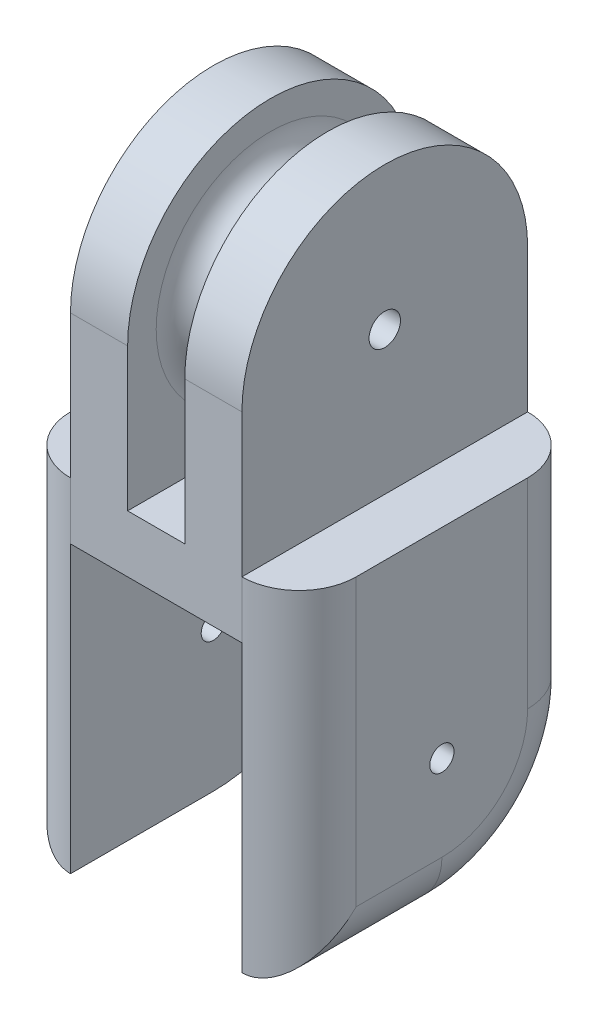
ISO-10303-21;
HEADER;
FILE_DESCRIPTION(('STEP AP214'),'2;1');
FILE_NAME('part.step','',(''),(''),'','','');
FILE_SCHEMA(('AUTOMOTIVE_DESIGN { 1 0 10303 214 1 1 1 1 }'));
ENDSEC;
DATA;
#1=APPLICATION_CONTEXT('core data for automotive mechanical design processes');
#2=APPLICATION_PROTOCOL_DEFINITION('international standard','automotive_design',2000,#1);
#3=PRODUCT_CONTEXT('',#1,'mechanical');
#4=PRODUCT('Part','Part','',(#3));
#5=PRODUCT_RELATED_PRODUCT_CATEGORY('part','',(#4));
#6=PRODUCT_DEFINITION_FORMATION('','',#4);
#7=PRODUCT_DEFINITION_CONTEXT('part definition',#1,'design');
#8=PRODUCT_DEFINITION('design','',#6,#7);
#9=PRODUCT_DEFINITION_SHAPE('','',#8);
#10=(LENGTH_UNIT() NAMED_UNIT(*) SI_UNIT(.MILLI.,.METRE.));
#11=(NAMED_UNIT(*) PLANE_ANGLE_UNIT() SI_UNIT($,.RADIAN.));
#12=(NAMED_UNIT(*) SI_UNIT($,.STERADIAN.) SOLID_ANGLE_UNIT());
#13=UNCERTAINTY_MEASURE_WITH_UNIT(LENGTH_MEASURE(1.E-05),#10,'distance_accuracy_value','');
#14=(GEOMETRIC_REPRESENTATION_CONTEXT(3) GLOBAL_UNCERTAINTY_ASSIGNED_CONTEXT((#13)) GLOBAL_UNIT_ASSIGNED_CONTEXT((#10,
#11,#12)) REPRESENTATION_CONTEXT('',''));
#15=CARTESIAN_POINT('',(0.,0.,0.));
#16=DIRECTION('',(0.,0.,1.));
#17=DIRECTION('',(1.,0.,0.));
#18=AXIS2_PLACEMENT_3D('',#15,#16,#17);
#19=CARTESIAN_POINT('',(0.,4.,0.));
#20=DIRECTION('',(0.,1.,0.));
#21=DIRECTION('',(0.,0.,1.));
#22=AXIS2_PLACEMENT_3D('',#19,#20,#21);
#23=PLANE('',#22);
#24=CARTESIAN_POINT('',(-6.,4.,6.));
#25=DIRECTION('',(0.,1.,0.));
#26=DIRECTION('',(0.,0.,1.));
#27=AXIS2_PLACEMENT_3D('',#24,#25,#26);
#28=CIRCLE('',#27,4.);
#29=CARTESIAN_POINT('',(-10.,4.,6.));
#30=VERTEX_POINT('',#29);
#31=CARTESIAN_POINT('',(-6.,4.,10.));
#32=VERTEX_POINT('',#31);
#33=EDGE_CURVE('E372',#30,#32,#28,.T.);
#34=ORIENTED_EDGE('',*,*,#33,.T.);
#35=DIRECTION('',(0.,0.,1.));
#36=VECTOR('',#35,1.);
#37=CARTESIAN_POINT('',(-6.,4.,10.));
#38=LINE('',#37,#36);
#39=CARTESIAN_POINT('',(-6.,4.,-10.));
#40=VERTEX_POINT('',#39);
#41=EDGE_CURVE('E172',#40,#32,#38,.T.);
#42=ORIENTED_EDGE('',*,*,#41,.F.);
#43=CARTESIAN_POINT('',(-6.,4.,-6.));
#44=DIRECTION('',(0.,1.,0.));
#45=DIRECTION('',(0.,0.,1.));
#46=AXIS2_PLACEMENT_3D('',#43,#44,#45);
#47=CIRCLE('',#46,4.);
#48=CARTESIAN_POINT('',(-10.,4.,-6.));
#49=VERTEX_POINT('',#48);
#50=EDGE_CURVE('E369',#40,#49,#47,.T.);
#51=ORIENTED_EDGE('',*,*,#50,.T.);
#52=DIRECTION('',(0.,0.,1.));
#53=VECTOR('',#52,1.);
#54=CARTESIAN_POINT('',(-10.,4.,-10.));
#55=LINE('',#54,#53);
#56=EDGE_CURVE('E310',#49,#30,#55,.T.);
#57=ORIENTED_EDGE('',*,*,#56,.T.);
#58=EDGE_LOOP('',(#34,#42,#51,#57));
#59=FACE_BOUND('',#58,.T.);
#60=ADVANCED_FACE('F39',(#59),#23,.T.);
#61=CARTESIAN_POINT('',(0.,4.,-6.));
#62=DIRECTION('',(0.,1.,0.));
#63=DIRECTION('',(0.,0.,1.));
#64=AXIS2_PLACEMENT_3D('',#61,#62,#63);
#65=CIRCLE('',#64,0.5);
#66=CARTESIAN_POINT('',(0.,4.,-5.5));
#67=VERTEX_POINT('',#66);
#68=EDGE_CURVE('E426',#67,#67,#65,.F.);
#69=ORIENTED_EDGE('',*,*,#68,.T.);
#70=EDGE_LOOP('',(#69));
#71=FACE_BOUND('',#70,.T.);
#72=CARTESIAN_POINT('',(0.,4.,6.));
#73=DIRECTION('',(0.,1.,0.));
#74=DIRECTION('',(0.,0.,1.));
#75=AXIS2_PLACEMENT_3D('',#72,#73,#74);
#76=CIRCLE('',#75,0.5);
#77=CARTESIAN_POINT('',(0.,4.,6.5));
#78=VERTEX_POINT('',#77);
#79=EDGE_CURVE('E435',#78,#78,#76,.F.);
#80=ORIENTED_EDGE('',*,*,#79,.T.);
#81=EDGE_LOOP('',(#80));
#82=FACE_BOUND('',#81,.T.);
#83=DIRECTION('',(-1.,0.,0.));
#84=VECTOR('',#83,1.);
#85=CARTESIAN_POINT('',(-10.,4.,-10.));
#86=LINE('',#85,#84);
#87=CARTESIAN_POINT('',(2.,4.,-10.));
#88=VERTEX_POINT('',#87);
#89=CARTESIAN_POINT('',(-2.,4.,-10.));
#90=VERTEX_POINT('',#89);
#91=EDGE_CURVE('E322',#88,#90,#86,.T.);
#92=ORIENTED_EDGE('',*,*,#91,.T.);
#93=DIRECTION('',(0.,0.,-1.));
#94=VECTOR('',#93,1.);
#95=CARTESIAN_POINT('',(-2.,4.,10.));
#96=LINE('',#95,#94);
#97=CARTESIAN_POINT('',(-2.,4.,10.));
#98=VERTEX_POINT('',#97);
#99=EDGE_CURVE('E56',#98,#90,#96,.T.);
#100=ORIENTED_EDGE('',*,*,#99,.F.);
#101=DIRECTION('',(1.,0.,0.));
#102=VECTOR('',#101,1.);
#103=CARTESIAN_POINT('',(-10.,4.,10.));
#104=LINE('',#103,#102);
#105=CARTESIAN_POINT('',(2.,4.,10.));
#106=VERTEX_POINT('',#105);
#107=EDGE_CURVE('E314',#98,#106,#104,.T.);
#108=ORIENTED_EDGE('',*,*,#107,.T.);
#109=DIRECTION('',(0.,0.,1.));
#110=VECTOR('',#109,1.);
#111=CARTESIAN_POINT('',(2.,4.,10.));
#112=LINE('',#111,#110);
#113=EDGE_CURVE('E231',#88,#106,#112,.T.);
#114=ORIENTED_EDGE('',*,*,#113,.F.);
#115=EDGE_LOOP('',(#92,#100,#108,#114));
#116=FACE_BOUND('',#115,.T.);
#117=ADVANCED_FACE('F512',(#71,#82,#116),#23,.T.);
#118=DIRECTION('',(0.,0.,-1.));
#119=VECTOR('',#118,1.);
#120=CARTESIAN_POINT('',(6.,4.,10.));
#121=LINE('',#120,#119);
#122=CARTESIAN_POINT('',(6.,4.,10.));
#123=VERTEX_POINT('',#122);
#124=CARTESIAN_POINT('',(6.,4.,-10.));
#125=VERTEX_POINT('',#124);
#126=EDGE_CURVE('E176',#123,#125,#121,.T.);
#127=ORIENTED_EDGE('',*,*,#126,.F.);
#128=CARTESIAN_POINT('',(6.,4.,6.));
#129=DIRECTION('',(0.,1.,0.));
#130=DIRECTION('',(0.,0.,1.));
#131=AXIS2_PLACEMENT_3D('',#128,#129,#130);
#132=CIRCLE('',#131,4.);
#133=CARTESIAN_POINT('',(10.,4.,6.));
#134=VERTEX_POINT('',#133);
#135=EDGE_CURVE('E375',#123,#134,#132,.T.);
#136=ORIENTED_EDGE('',*,*,#135,.T.);
#137=DIRECTION('',(0.,0.,-1.));
#138=VECTOR('',#137,1.);
#139=CARTESIAN_POINT('',(10.,4.,-10.));
#140=LINE('',#139,#138);
#141=CARTESIAN_POINT('',(10.,4.,-6.));
#142=VERTEX_POINT('',#141);
#143=EDGE_CURVE('E318',#134,#142,#140,.T.);
#144=ORIENTED_EDGE('',*,*,#143,.T.);
#145=CARTESIAN_POINT('',(6.,4.,-6.));
#146=DIRECTION('',(0.,1.,0.));
#147=DIRECTION('',(0.,0.,1.));
#148=AXIS2_PLACEMENT_3D('',#145,#146,#147);
#149=CIRCLE('',#148,4.);
#150=EDGE_CURVE('E365',#142,#125,#149,.T.);
#151=ORIENTED_EDGE('',*,*,#150,.T.);
#152=EDGE_LOOP('',(#127,#136,#144,#151));
#153=FACE_BOUND('',#152,.T.);
#154=ADVANCED_FACE('F448',(#153),#23,.T.);
#155=CARTESIAN_POINT('',(0.,0.,0.));
#156=DIRECTION('',(0.,1.,0.));
#157=DIRECTION('',(0.,0.,1.));
#158=AXIS2_PLACEMENT_3D('',#155,#156,#157);
#159=PLANE('',#158);
#160=CARTESIAN_POINT('',(0.,0.,-6.));
#161=DIRECTION('',(0.,-1.,0.));
#162=DIRECTION('',(0.,0.,-1.));
#163=AXIS2_PLACEMENT_3D('',#160,#161,#162);
#164=CIRCLE('',#163,0.5);
#165=CARTESIAN_POINT('',(0.,0.,-6.5));
#166=VERTEX_POINT('',#165);
#167=EDGE_CURVE('E420',#166,#166,#164,.T.);
#168=ORIENTED_EDGE('',*,*,#167,.F.);
#169=EDGE_LOOP('',(#168));
#170=FACE_BOUND('',#169,.T.);
#171=CARTESIAN_POINT('',(0.,0.,6.));
#172=DIRECTION('',(0.,-1.,0.));
#173=DIRECTION('',(0.,0.,1.));
#174=AXIS2_PLACEMENT_3D('',#171,#172,#173);
#175=CIRCLE('',#174,0.5);
#176=CARTESIAN_POINT('',(0.,0.,6.5));
#177=VERTEX_POINT('',#176);
#178=EDGE_CURVE('E432',#177,#177,#175,.T.);
#179=ORIENTED_EDGE('',*,*,#178,.F.);
#180=EDGE_LOOP('',(#179));
#181=FACE_BOUND('',#180,.T.);
#182=DIRECTION('',(0.,0.,-1.));
#183=VECTOR('',#182,1.);
#184=CARTESIAN_POINT('',(6.,0.,-10.));
#185=LINE('',#184,#183);
#186=CARTESIAN_POINT('',(6.,0.,10.));
#187=VERTEX_POINT('',#186);
#188=CARTESIAN_POINT('',(6.,0.,-10.));
#189=VERTEX_POINT('',#188);
#190=EDGE_CURVE('E286',#187,#189,#185,.T.);
#191=ORIENTED_EDGE('',*,*,#190,.F.);
#192=DIRECTION('',(1.,0.,0.));
#193=VECTOR('',#192,1.);
#194=CARTESIAN_POINT('',(-10.,0.,10.));
#195=LINE('',#194,#193);
#196=CARTESIAN_POINT('',(-6.,0.,10.));
#197=VERTEX_POINT('',#196);
#198=EDGE_CURVE('E309',#197,#187,#195,.T.);
#199=ORIENTED_EDGE('',*,*,#198,.F.);
#200=DIRECTION('',(0.,0.,1.));
#201=VECTOR('',#200,1.);
#202=CARTESIAN_POINT('',(-6.,0.,10.));
#203=LINE('',#202,#201);
#204=CARTESIAN_POINT('',(-6.,0.,-10.));
#205=VERTEX_POINT('',#204);
#206=EDGE_CURVE('E297',#205,#197,#203,.T.);
#207=ORIENTED_EDGE('',*,*,#206,.F.);
#208=DIRECTION('',(-1.,0.,0.));
#209=VECTOR('',#208,1.);
#210=CARTESIAN_POINT('',(-10.,0.,-10.));
#211=LINE('',#210,#209);
#212=EDGE_CURVE('E315',#189,#205,#211,.T.);
#213=ORIENTED_EDGE('',*,*,#212,.F.);
#214=EDGE_LOOP('',(#191,#199,#207,#213));
#215=FACE_BOUND('',#214,.T.);
#216=ADVANCED_FACE('F444',(#170,#181,#215),#159,.F.);
#217=CARTESIAN_POINT('',(-10.,4.,-10.));
#218=DIRECTION('',(1.,0.,0.));
#219=DIRECTION('',(0.,0.,-1.));
#220=AXIS2_PLACEMENT_3D('',#217,#218,#219);
#221=PLANE('',#220);
#222=CARTESIAN_POINT('',(-10.,-10.,0.));
#223=DIRECTION('',(-1.,0.,0.));
#224=DIRECTION('',(0.,0.,1.));
#225=AXIS2_PLACEMENT_3D('',#222,#223,#224);
#226=CIRCLE('',#225,0.85);
#227=CARTESIAN_POINT('',(-10.,-10.,0.850000000000001));
#228=VERTEX_POINT('',#227);
#229=EDGE_CURVE('E261',#228,#228,#226,.T.);
#230=ORIENTED_EDGE('',*,*,#229,.F.);
#231=EDGE_LOOP('',(#230));
#232=FACE_BOUND('',#231,.T.);
#233=DIRECTION('',(0.,0.,1.));
#234=VECTOR('',#233,1.);
#235=CARTESIAN_POINT('',(-10.,-16.,10.));
#236=LINE('',#235,#234);
#237=CARTESIAN_POINT('',(-10.,-16.,0.));
#238=VERTEX_POINT('',#237);
#239=CARTESIAN_POINT('',(-10.,-16.,6.));
#240=VERTEX_POINT('',#239);
#241=EDGE_CURVE('E338',#238,#240,#236,.T.);
#242=ORIENTED_EDGE('',*,*,#241,.T.);
#243=DIRECTION('',(0.,-1.,0.));
#244=VECTOR('',#243,1.);
#245=CARTESIAN_POINT('',(-10.,4.,6.));
#246=LINE('',#245,#244);
#247=EDGE_CURVE('E342',#240,#30,#246,.F.);
#248=ORIENTED_EDGE('',*,*,#247,.T.);
#249=ORIENTED_EDGE('',*,*,#56,.F.);
#250=DIRECTION('',(0.,-1.,0.));
#251=VECTOR('',#250,1.);
#252=CARTESIAN_POINT('',(-10.,4.,-6.));
#253=LINE('',#252,#251);
#254=CARTESIAN_POINT('',(-10.,-10.,-6.));
#255=VERTEX_POINT('',#254);
#256=EDGE_CURVE('E325',#49,#255,#253,.T.);
#257=ORIENTED_EDGE('',*,*,#256,.T.);
#258=CARTESIAN_POINT('',(-10.,-10.,0.));
#259=DIRECTION('',(1.,0.,0.));
#260=DIRECTION('',(0.,0.,-1.));
#261=AXIS2_PLACEMENT_3D('',#258,#259,#260);
#262=CIRCLE('',#261,6.);
#263=EDGE_CURVE('E335',#255,#238,#262,.F.);
#264=ORIENTED_EDGE('',*,*,#263,.T.);
#265=EDGE_LOOP('',(#242,#248,#249,#257,#264));
#266=FACE_BOUND('',#265,.T.);
#267=ADVANCED_FACE('F447',(#232,#266),#221,.F.);
#268=CARTESIAN_POINT('',(-10.,4.,10.));
#269=DIRECTION('',(0.,0.,-1.));
#270=DIRECTION('',(-1.,0.,0.));
#271=AXIS2_PLACEMENT_3D('',#268,#269,#270);
#272=PLANE('',#271);
#273=ORIENTED_EDGE('',*,*,#198,.T.);
#274=DIRECTION('',(0.,-1.,0.));
#275=VECTOR('',#274,1.);
#276=CARTESIAN_POINT('',(6.,4.,10.));
#277=LINE('',#276,#275);
#278=EDGE_CURVE('E361',#187,#123,#277,.F.);
#279=ORIENTED_EDGE('',*,*,#278,.T.);
#280=DIRECTION('',(0.,-1.,0.));
#281=VECTOR('',#280,1.);
#282=CARTESIAN_POINT('',(6.,14.,10.));
#283=LINE('',#282,#281);
#284=CARTESIAN_POINT('',(6.,14.,10.));
#285=VERTEX_POINT('',#284);
#286=EDGE_CURVE('E235',#285,#123,#283,.T.);
#287=ORIENTED_EDGE('',*,*,#286,.F.);
#288=DIRECTION('',(1.,0.,0.));
#289=VECTOR('',#288,1.);
#290=CARTESIAN_POINT('',(6.,14.,10.));
#291=LINE('',#290,#289);
#292=CARTESIAN_POINT('',(2.,14.,10.));
#293=VERTEX_POINT('',#292);
#294=EDGE_CURVE('E230',#293,#285,#291,.T.);
#295=ORIENTED_EDGE('',*,*,#294,.F.);
#296=DIRECTION('',(0.,-1.,0.));
#297=VECTOR('',#296,1.);
#298=CARTESIAN_POINT('',(2.,14.,10.));
#299=LINE('',#298,#297);
#300=EDGE_CURVE('E243',#293,#106,#299,.T.);
#301=ORIENTED_EDGE('',*,*,#300,.T.);
#302=ORIENTED_EDGE('',*,*,#107,.F.);
#303=DIRECTION('',(0.,-1.,0.));
#304=VECTOR('',#303,1.);
#305=CARTESIAN_POINT('',(-2.,14.,10.));
#306=LINE('',#305,#304);
#307=CARTESIAN_POINT('',(-2.,14.,10.));
#308=VERTEX_POINT('',#307);
#309=EDGE_CURVE('E177',#308,#98,#306,.T.);
#310=ORIENTED_EDGE('',*,*,#309,.F.);
#311=DIRECTION('',(1.,0.,0.));
#312=VECTOR('',#311,1.);
#313=CARTESIAN_POINT('',(-6.,14.,10.));
#314=LINE('',#313,#312);
#315=CARTESIAN_POINT('',(-6.,14.,10.));
#316=VERTEX_POINT('',#315);
#317=EDGE_CURVE('E180',#316,#308,#314,.T.);
#318=ORIENTED_EDGE('',*,*,#317,.F.);
#319=DIRECTION('',(0.,-1.,0.));
#320=VECTOR('',#319,1.);
#321=CARTESIAN_POINT('',(-6.,14.,10.));
#322=LINE('',#321,#320);
#323=EDGE_CURVE('E165',#316,#32,#322,.T.);
#324=ORIENTED_EDGE('',*,*,#323,.T.);
#325=DIRECTION('',(0.,-1.,0.));
#326=VECTOR('',#325,1.);
#327=CARTESIAN_POINT('',(-6.,4.,10.));
#328=LINE('',#327,#326);
#329=EDGE_CURVE('E358',#32,#197,#328,.T.);
#330=ORIENTED_EDGE('',*,*,#329,.T.);
#331=EDGE_LOOP('',(#273,#279,#287,#295,#301,#302,#310,#318,#324,#330));
#332=FACE_BOUND('',#331,.T.);
#333=ADVANCED_FACE('F182',(#332),#272,.F.);
#334=CARTESIAN_POINT('',(10.,4.,-10.));
#335=DIRECTION('',(-1.,0.,0.));
#336=DIRECTION('',(0.,0.,1.));
#337=AXIS2_PLACEMENT_3D('',#334,#335,#336);
#338=PLANE('',#337);
#339=CARTESIAN_POINT('',(10.,-10.,0.));
#340=DIRECTION('',(-1.,0.,0.));
#341=DIRECTION('',(0.,0.,1.));
#342=AXIS2_PLACEMENT_3D('',#339,#340,#341);
#343=CIRCLE('',#342,0.85);
#344=CARTESIAN_POINT('',(10.,-10.,0.849999999999999));
#345=VERTEX_POINT('',#344);
#346=EDGE_CURVE('E256',#345,#345,#343,.T.);
#347=ORIENTED_EDGE('',*,*,#346,.T.);
#348=EDGE_LOOP('',(#347));
#349=FACE_BOUND('',#348,.T.);
#350=ORIENTED_EDGE('',*,*,#143,.F.);
#351=DIRECTION('',(0.,-1.,0.));
#352=VECTOR('',#351,1.);
#353=CARTESIAN_POINT('',(10.,4.,6.));
#354=LINE('',#353,#352);
#355=CARTESIAN_POINT('',(10.,-16.,6.));
#356=VERTEX_POINT('',#355);
#357=EDGE_CURVE('E355',#134,#356,#354,.T.);
#358=ORIENTED_EDGE('',*,*,#357,.T.);
#359=DIRECTION('',(0.,0.,-1.));
#360=VECTOR('',#359,1.);
#361=CARTESIAN_POINT('',(10.,-16.,0.));
#362=LINE('',#361,#360);
#363=CARTESIAN_POINT('',(10.,-16.,0.));
#364=VERTEX_POINT('',#363);
#365=EDGE_CURVE('E351',#356,#364,#362,.T.);
#366=ORIENTED_EDGE('',*,*,#365,.T.);
#367=CARTESIAN_POINT('',(10.,-10.,0.));
#368=DIRECTION('',(-1.,0.,0.));
#369=DIRECTION('',(0.,0.,1.));
#370=AXIS2_PLACEMENT_3D('',#367,#368,#369);
#371=CIRCLE('',#370,6.);
#372=CARTESIAN_POINT('',(10.,-10.,-6.));
#373=VERTEX_POINT('',#372);
#374=EDGE_CURVE('E348',#364,#373,#371,.F.);
#375=ORIENTED_EDGE('',*,*,#374,.T.);
#376=DIRECTION('',(0.,-1.,0.));
#377=VECTOR('',#376,1.);
#378=CARTESIAN_POINT('',(10.,4.,-6.));
#379=LINE('',#378,#377);
#380=EDGE_CURVE('E345',#373,#142,#379,.F.);
#381=ORIENTED_EDGE('',*,*,#380,.T.);
#382=EDGE_LOOP('',(#350,#358,#366,#375,#381));
#383=FACE_BOUND('',#382,.T.);
#384=ADVANCED_FACE('F507',(#349,#383),#338,.F.);
#385=CARTESIAN_POINT('',(-10.,4.,-10.));
#386=DIRECTION('',(0.,0.,1.));
#387=DIRECTION('',(1.,0.,0.));
#388=AXIS2_PLACEMENT_3D('',#385,#386,#387);
#389=PLANE('',#388);
#390=ORIENTED_EDGE('',*,*,#212,.T.);
#391=DIRECTION('',(0.,-1.,0.));
#392=VECTOR('',#391,1.);
#393=CARTESIAN_POINT('',(-6.,4.,-10.));
#394=LINE('',#393,#392);
#395=EDGE_CURVE('E381',#205,#40,#394,.F.);
#396=ORIENTED_EDGE('',*,*,#395,.T.);
#397=DIRECTION('',(0.,-1.,0.));
#398=VECTOR('',#397,1.);
#399=CARTESIAN_POINT('',(-6.,14.,-10.));
#400=LINE('',#399,#398);
#401=CARTESIAN_POINT('',(-6.,14.,-10.));
#402=VERTEX_POINT('',#401);
#403=EDGE_CURVE('E213',#402,#40,#400,.T.);
#404=ORIENTED_EDGE('',*,*,#403,.F.);
#405=DIRECTION('',(-1.,0.,0.));
#406=VECTOR('',#405,1.);
#407=CARTESIAN_POINT('',(-6.,14.,-10.));
#408=LINE('',#407,#406);
#409=CARTESIAN_POINT('',(-2.,14.,-10.));
#410=VERTEX_POINT('',#409);
#411=EDGE_CURVE('E187',#410,#402,#408,.T.);
#412=ORIENTED_EDGE('',*,*,#411,.F.);
#413=DIRECTION('',(0.,-1.,0.));
#414=VECTOR('',#413,1.);
#415=CARTESIAN_POINT('',(-2.,14.,-10.));
#416=LINE('',#415,#414);
#417=EDGE_CURVE('E220',#410,#90,#416,.T.);
#418=ORIENTED_EDGE('',*,*,#417,.T.);
#419=ORIENTED_EDGE('',*,*,#91,.F.);
#420=DIRECTION('',(0.,-1.,0.));
#421=VECTOR('',#420,1.);
#422=CARTESIAN_POINT('',(2.,14.,-10.));
#423=LINE('',#422,#421);
#424=CARTESIAN_POINT('',(2.,14.,-10.));
#425=VERTEX_POINT('',#424);
#426=EDGE_CURVE('E247',#425,#88,#423,.T.);
#427=ORIENTED_EDGE('',*,*,#426,.F.);
#428=DIRECTION('',(-1.,0.,0.));
#429=VECTOR('',#428,1.);
#430=CARTESIAN_POINT('',(6.,14.,-10.));
#431=LINE('',#430,#429);
#432=CARTESIAN_POINT('',(6.,14.,-10.));
#433=VERTEX_POINT('',#432);
#434=EDGE_CURVE('E226',#433,#425,#431,.T.);
#435=ORIENTED_EDGE('',*,*,#434,.F.);
#436=DIRECTION('',(0.,-1.,0.));
#437=VECTOR('',#436,1.);
#438=CARTESIAN_POINT('',(6.,14.,-10.));
#439=LINE('',#438,#437);
#440=EDGE_CURVE('E251',#433,#125,#439,.T.);
#441=ORIENTED_EDGE('',*,*,#440,.T.);
#442=DIRECTION('',(0.,-1.,0.));
#443=VECTOR('',#442,1.);
#444=CARTESIAN_POINT('',(6.,4.,-10.));
#445=LINE('',#444,#443);
#446=EDGE_CURVE('E378',#125,#189,#445,.T.);
#447=ORIENTED_EDGE('',*,*,#446,.T.);
#448=EDGE_LOOP('',(#390,#396,#404,#412,#418,#419,#427,#435,#441,#447));
#449=FACE_BOUND('',#448,.T.);
#450=ADVANCED_FACE('F477',(#449),#389,.F.);
#451=CARTESIAN_POINT('',(-6.,-10.,10.));
#452=DIRECTION('',(-1.,0.,0.));
#453=DIRECTION('',(0.,0.,1.));
#454=AXIS2_PLACEMENT_3D('',#451,#452,#453);
#455=PLANE('',#454);
#456=CARTESIAN_POINT('',(-6.,-10.,0.));
#457=DIRECTION('',(-1.,0.,0.));
#458=DIRECTION('',(0.,0.,1.));
#459=AXIS2_PLACEMENT_3D('',#456,#457,#458);
#460=CIRCLE('',#459,0.85);
#461=CARTESIAN_POINT('',(-6.,-10.,0.850000000000001));
#462=VERTEX_POINT('',#461);
#463=EDGE_CURVE('E266',#462,#462,#460,.T.);
#464=ORIENTED_EDGE('',*,*,#463,.T.);
#465=EDGE_LOOP('',(#464));
#466=FACE_BOUND('',#465,.T.);
#467=ORIENTED_EDGE('',*,*,#206,.T.);
#468=DIRECTION('',(0.,1.,0.));
#469=VECTOR('',#468,1.);
#470=CARTESIAN_POINT('',(-6.,-10.,10.));
#471=LINE('',#470,#469);
#472=CARTESIAN_POINT('',(-6.,-20.,10.));
#473=VERTEX_POINT('',#472);
#474=EDGE_CURVE('E301',#473,#197,#471,.T.);
#475=ORIENTED_EDGE('',*,*,#474,.F.);
#476=DIRECTION('',(0.,0.,1.));
#477=VECTOR('',#476,1.);
#478=CARTESIAN_POINT('',(-6.,-20.,0.));
#479=LINE('',#478,#477);
#480=CARTESIAN_POINT('',(-6.,-20.,0.));
#481=VERTEX_POINT('',#480);
#482=EDGE_CURVE('E282',#481,#473,#479,.T.);
#483=ORIENTED_EDGE('',*,*,#482,.F.);
#484=CARTESIAN_POINT('',(-6.,-10.,0.));
#485=DIRECTION('',(-1.,0.,0.));
#486=DIRECTION('',(0.,0.,1.));
#487=AXIS2_PLACEMENT_3D('',#484,#485,#486);
#488=CIRCLE('',#487,10.);
#489=CARTESIAN_POINT('',(-6.,-10.,-10.));
#490=VERTEX_POINT('',#489);
#491=EDGE_CURVE('E278',#490,#481,#488,.T.);
#492=ORIENTED_EDGE('',*,*,#491,.F.);
#493=DIRECTION('',(0.,1.,0.));
#494=VECTOR('',#493,1.);
#495=CARTESIAN_POINT('',(-6.,-10.,-10.));
#496=LINE('',#495,#494);
#497=EDGE_CURVE('E305',#490,#205,#496,.T.);
#498=ORIENTED_EDGE('',*,*,#497,.T.);
#499=EDGE_LOOP('',(#467,#475,#483,#492,#498));
#500=FACE_BOUND('',#499,.T.);
#501=ADVANCED_FACE('F489',(#466,#500),#455,.F.);
#502=CARTESIAN_POINT('',(6.,-10.,-10.));
#503=DIRECTION('',(1.,0.,0.));
#504=DIRECTION('',(0.,0.,-1.));
#505=AXIS2_PLACEMENT_3D('',#502,#503,#504);
#506=PLANE('',#505);
#507=CARTESIAN_POINT('',(6.,-10.,0.));
#508=DIRECTION('',(1.,0.,0.));
#509=DIRECTION('',(0.,0.,-1.));
#510=AXIS2_PLACEMENT_3D('',#507,#508,#509);
#511=CIRCLE('',#510,0.85);
#512=CARTESIAN_POINT('',(6.,-10.,-0.850000000000001));
#513=VERTEX_POINT('',#512);
#514=EDGE_CURVE('E260',#513,#513,#511,.T.);
#515=ORIENTED_EDGE('',*,*,#514,.T.);
#516=EDGE_LOOP('',(#515));
#517=FACE_BOUND('',#516,.T.);
#518=ORIENTED_EDGE('',*,*,#190,.T.);
#519=DIRECTION('',(0.,1.,0.));
#520=VECTOR('',#519,1.);
#521=CARTESIAN_POINT('',(6.,-10.,-10.));
#522=LINE('',#521,#520);
#523=CARTESIAN_POINT('',(6.,-10.,-10.));
#524=VERTEX_POINT('',#523);
#525=EDGE_CURVE('E290',#524,#189,#522,.T.);
#526=ORIENTED_EDGE('',*,*,#525,.F.);
#527=CARTESIAN_POINT('',(6.,-10.,0.));
#528=DIRECTION('',(1.,0.,0.));
#529=DIRECTION('',(0.,0.,-1.));
#530=AXIS2_PLACEMENT_3D('',#527,#528,#529);
#531=CIRCLE('',#530,10.);
#532=CARTESIAN_POINT('',(6.,-20.,0.));
#533=VERTEX_POINT('',#532);
#534=EDGE_CURVE('E274',#533,#524,#531,.T.);
#535=ORIENTED_EDGE('',*,*,#534,.F.);
#536=DIRECTION('',(0.,0.,-1.));
#537=VECTOR('',#536,1.);
#538=CARTESIAN_POINT('',(6.,-20.,0.));
#539=LINE('',#538,#537);
#540=CARTESIAN_POINT('',(6.,-20.,9.99999999999999));
#541=VERTEX_POINT('',#540);
#542=EDGE_CURVE('E270',#541,#533,#539,.T.);
#543=ORIENTED_EDGE('',*,*,#542,.F.);
#544=DIRECTION('',(0.,1.,0.));
#545=VECTOR('',#544,1.);
#546=CARTESIAN_POINT('',(6.,-10.,10.));
#547=LINE('',#546,#545);
#548=EDGE_CURVE('E294',#541,#187,#547,.T.);
#549=ORIENTED_EDGE('',*,*,#548,.T.);
#550=EDGE_LOOP('',(#518,#526,#535,#543,#549));
#551=FACE_BOUND('',#550,.T.);
#552=ADVANCED_FACE('F528',(#517,#551),#506,.F.);
#553=CARTESIAN_POINT('',(10.,-10.,0.));
#554=DIRECTION('',(-1.,0.,0.));
#555=DIRECTION('',(0.,0.,1.));
#556=AXIS2_PLACEMENT_3D('',#553,#554,#555);
#557=CYLINDRICAL_SURFACE('',#556,0.85);
#558=ORIENTED_EDGE('',*,*,#346,.F.);
#559=EDGE_LOOP('',(#558));
#560=FACE_BOUND('',#559,.T.);
#561=ORIENTED_EDGE('',*,*,#514,.F.);
#562=EDGE_LOOP('',(#561));
#563=FACE_BOUND('',#562,.T.);
#564=ADVANCED_FACE('F546',(#560,#563),#557,.F.);
#565=ORIENTED_EDGE('',*,*,#229,.T.);
#566=EDGE_LOOP('',(#565));
#567=FACE_BOUND('',#566,.T.);
#568=ORIENTED_EDGE('',*,*,#463,.F.);
#569=EDGE_LOOP('',(#568));
#570=FACE_BOUND('',#569,.T.);
#571=ADVANCED_FACE('F549',(#567,#570),#557,.F.);
#572=CARTESIAN_POINT('',(-6.,4.,-6.));
#573=DIRECTION('',(0.,-1.,0.));
#574=DIRECTION('',(0.,0.,-1.));
#575=AXIS2_PLACEMENT_3D('',#572,#573,#574);
#576=CYLINDRICAL_SURFACE('',#575,4.);
#577=ORIENTED_EDGE('',*,*,#395,.F.);
#578=ORIENTED_EDGE('',*,*,#497,.F.);
#579=CARTESIAN_POINT('',(-6.,-10.,-6.));
#580=DIRECTION('',(0.,-1.,0.));
#581=DIRECTION('',(0.,0.,-1.));
#582=AXIS2_PLACEMENT_3D('',#579,#580,#581);
#583=CIRCLE('',#582,4.);
#584=EDGE_CURVE('E265',#255,#490,#583,.T.);
#585=ORIENTED_EDGE('',*,*,#584,.F.);
#586=ORIENTED_EDGE('',*,*,#256,.F.);
#587=ORIENTED_EDGE('',*,*,#50,.F.);
#588=EDGE_LOOP('',(#577,#578,#585,#586,#587));
#589=FACE_BOUND('',#588,.T.);
#590=ADVANCED_FACE('F498',(#589),#576,.T.);
#591=CARTESIAN_POINT('',(-6.,-10.,0.));
#592=DIRECTION('',(1.,0.,0.));
#593=DIRECTION('',(0.,0.,-1.));
#594=AXIS2_PLACEMENT_3D('',#591,#592,#593);
#595=TOROIDAL_SURFACE('',#594,6.,4.);
#596=ORIENTED_EDGE('',*,*,#584,.T.);
#597=ORIENTED_EDGE('',*,*,#491,.T.);
#598=CARTESIAN_POINT('',(-6.,-16.,0.));
#599=DIRECTION('',(0.,0.,1.));
#600=DIRECTION('',(1.,0.,0.));
#601=AXIS2_PLACEMENT_3D('',#598,#599,#600);
#602=CIRCLE('',#601,4.);
#603=EDGE_CURVE('E388',#238,#481,#602,.T.);
#604=ORIENTED_EDGE('',*,*,#603,.F.);
#605=ORIENTED_EDGE('',*,*,#263,.F.);
#606=EDGE_LOOP('',(#596,#597,#604,#605));
#607=FACE_BOUND('',#606,.T.);
#608=ADVANCED_FACE('F496',(#607),#595,.T.);
#609=CARTESIAN_POINT('',(-6.,4.,6.));
#610=DIRECTION('',(0.,-1.,0.));
#611=DIRECTION('',(0.,0.,-1.));
#612=AXIS2_PLACEMENT_3D('',#609,#610,#611);
#613=CYLINDRICAL_SURFACE('',#612,4.);
#614=ORIENTED_EDGE('',*,*,#33,.F.);
#615=ORIENTED_EDGE('',*,*,#247,.F.);
#616=CARTESIAN_POINT('',(-6.,-16.,6.));
#617=DIRECTION('',(0.,-0.707106781186547,-0.707106781186547));
#618=DIRECTION('',(0.,-0.707106781186547,0.707106781186547));
#619=AXIS2_PLACEMENT_3D('',#616,#617,#618);
#620=ELLIPSE('',#619,5.65685424949238,4.);
#621=EDGE_CURVE('E385',#473,#240,#620,.T.);
#622=ORIENTED_EDGE('',*,*,#621,.F.);
#623=ORIENTED_EDGE('',*,*,#474,.T.);
#624=ORIENTED_EDGE('',*,*,#329,.F.);
#625=EDGE_LOOP('',(#614,#615,#622,#623,#624));
#626=FACE_BOUND('',#625,.T.);
#627=ADVANCED_FACE('F486',(#626),#613,.T.);
#628=CARTESIAN_POINT('',(-6.,-16.,-10.));
#629=DIRECTION('',(0.,0.,-1.));
#630=DIRECTION('',(-1.,0.,0.));
#631=AXIS2_PLACEMENT_3D('',#628,#629,#630);
#632=CYLINDRICAL_SURFACE('',#631,4.);
#633=ORIENTED_EDGE('',*,*,#603,.T.);
#634=ORIENTED_EDGE('',*,*,#482,.T.);
#635=ORIENTED_EDGE('',*,*,#621,.T.);
#636=ORIENTED_EDGE('',*,*,#241,.F.);
#637=EDGE_LOOP('',(#633,#634,#635,#636));
#638=FACE_BOUND('',#637,.T.);
#639=ADVANCED_FACE('F491',(#638),#632,.T.);
#640=CARTESIAN_POINT('',(6.,4.,-6.));
#641=DIRECTION('',(0.,-1.,0.));
#642=DIRECTION('',(0.,0.,-1.));
#643=AXIS2_PLACEMENT_3D('',#640,#641,#642);
#644=CYLINDRICAL_SURFACE('',#643,4.);
#645=ORIENTED_EDGE('',*,*,#150,.F.);
#646=ORIENTED_EDGE('',*,*,#380,.F.);
#647=CARTESIAN_POINT('',(6.,-10.,-6.));
#648=DIRECTION('',(0.,-1.,0.));
#649=DIRECTION('',(0.,0.,-1.));
#650=AXIS2_PLACEMENT_3D('',#647,#648,#649);
#651=CIRCLE('',#650,4.);
#652=EDGE_CURVE('E389',#524,#373,#651,.T.);
#653=ORIENTED_EDGE('',*,*,#652,.F.);
#654=ORIENTED_EDGE('',*,*,#525,.T.);
#655=ORIENTED_EDGE('',*,*,#446,.F.);
#656=EDGE_LOOP('',(#645,#646,#653,#654,#655));
#657=FACE_BOUND('',#656,.T.);
#658=ADVANCED_FACE('F526',(#657),#644,.T.);
#659=CARTESIAN_POINT('',(6.,4.,6.));
#660=DIRECTION('',(0.,-1.,0.));
#661=DIRECTION('',(0.,0.,-1.));
#662=AXIS2_PLACEMENT_3D('',#659,#660,#661);
#663=CYLINDRICAL_SURFACE('',#662,4.);
#664=ORIENTED_EDGE('',*,*,#278,.F.);
#665=ORIENTED_EDGE('',*,*,#548,.F.);
#666=CARTESIAN_POINT('',(6.,-16.,6.));
#667=DIRECTION('',(0.,-0.707106781186547,-0.707106781186547));
#668=DIRECTION('',(0.,-0.707106781186547,0.707106781186547));
#669=AXIS2_PLACEMENT_3D('',#666,#667,#668);
#670=ELLIPSE('',#669,5.65685424949238,4.);
#671=EDGE_CURVE('E398',#356,#541,#670,.T.);
#672=ORIENTED_EDGE('',*,*,#671,.F.);
#673=ORIENTED_EDGE('',*,*,#357,.F.);
#674=ORIENTED_EDGE('',*,*,#135,.F.);
#675=EDGE_LOOP('',(#664,#665,#672,#673,#674));
#676=FACE_BOUND('',#675,.T.);
#677=ADVANCED_FACE('F461',(#676),#663,.T.);
#678=CARTESIAN_POINT('',(6.,-10.,0.));
#679=DIRECTION('',(-1.,0.,0.));
#680=DIRECTION('',(0.,0.,1.));
#681=AXIS2_PLACEMENT_3D('',#678,#679,#680);
#682=TOROIDAL_SURFACE('',#681,6.,4.);
#683=ORIENTED_EDGE('',*,*,#652,.T.);
#684=ORIENTED_EDGE('',*,*,#374,.F.);
#685=CARTESIAN_POINT('',(6.,-16.,0.));
#686=DIRECTION('',(0.,0.,1.));
#687=DIRECTION('',(1.,0.,0.));
#688=AXIS2_PLACEMENT_3D('',#685,#686,#687);
#689=CIRCLE('',#688,4.);
#690=EDGE_CURVE('E255',#533,#364,#689,.T.);
#691=ORIENTED_EDGE('',*,*,#690,.F.);
#692=ORIENTED_EDGE('',*,*,#534,.T.);
#693=EDGE_LOOP('',(#683,#684,#691,#692));
#694=FACE_BOUND('',#693,.T.);
#695=ADVANCED_FACE('F535',(#694),#682,.T.);
#696=CARTESIAN_POINT('',(6.,-16.,-10.));
#697=DIRECTION('',(0.,0.,1.));
#698=DIRECTION('',(1.,0.,0.));
#699=AXIS2_PLACEMENT_3D('',#696,#697,#698);
#700=CYLINDRICAL_SURFACE('',#699,4.);
#701=ORIENTED_EDGE('',*,*,#671,.T.);
#702=ORIENTED_EDGE('',*,*,#542,.T.);
#703=ORIENTED_EDGE('',*,*,#690,.T.);
#704=ORIENTED_EDGE('',*,*,#365,.F.);
#705=EDGE_LOOP('',(#701,#702,#703,#704));
#706=FACE_BOUND('',#705,.T.);
#707=ADVANCED_FACE('F532',(#706),#700,.T.);
#708=CARTESIAN_POINT('',(6.,14.,10.));
#709=DIRECTION('',(-1.,0.,0.));
#710=DIRECTION('',(0.,0.,1.));
#711=AXIS2_PLACEMENT_3D('',#708,#709,#710);
#712=PLANE('',#711);
#713=CARTESIAN_POINT('',(6.,14.,0.));
#714=DIRECTION('',(-1.,0.,0.));
#715=DIRECTION('',(0.,0.,1.));
#716=AXIS2_PLACEMENT_3D('',#713,#714,#715);
#717=CIRCLE('',#716,1.1);
#718=CARTESIAN_POINT('',(6.,14.,1.1));
#719=VERTEX_POINT('',#718);
#720=EDGE_CURVE('E194',#719,#719,#717,.T.);
#721=ORIENTED_EDGE('',*,*,#720,.T.);
#722=EDGE_LOOP('',(#721));
#723=FACE_BOUND('',#722,.T.);
#724=ORIENTED_EDGE('',*,*,#126,.T.);
#725=ORIENTED_EDGE('',*,*,#440,.F.);
#726=CARTESIAN_POINT('',(6.,14.,0.));
#727=DIRECTION('',(1.,0.,0.));
#728=DIRECTION('',(0.,0.,-1.));
#729=AXIS2_PLACEMENT_3D('',#726,#727,#728);
#730=CIRCLE('',#729,10.);
#731=EDGE_CURVE('E198',#433,#285,#730,.T.);
#732=ORIENTED_EDGE('',*,*,#731,.T.);
#733=ORIENTED_EDGE('',*,*,#286,.T.);
#734=EDGE_LOOP('',(#724,#725,#732,#733));
#735=FACE_BOUND('',#734,.T.);
#736=ADVANCED_FACE('F467',(#723,#735),#712,.F.);
#737=CARTESIAN_POINT('',(2.,14.,10.));
#738=DIRECTION('',(1.,0.,0.));
#739=DIRECTION('',(0.,0.,-1.));
#740=AXIS2_PLACEMENT_3D('',#737,#738,#739);
#741=PLANE('',#740);
#742=CARTESIAN_POINT('',(2.,14.,0.));
#743=DIRECTION('',(1.,0.,0.));
#744=DIRECTION('',(0.,0.,-1.));
#745=AXIS2_PLACEMENT_3D('',#742,#743,#744);
#746=CIRCLE('',#745,8.);
#747=CARTESIAN_POINT('',(2.,14.,-8.));
#748=VERTEX_POINT('',#747);
#749=EDGE_CURVE('E49',#748,#748,#746,.T.);
#750=ORIENTED_EDGE('',*,*,#749,.T.);
#751=EDGE_LOOP('',(#750));
#752=FACE_BOUND('',#751,.T.);
#753=ORIENTED_EDGE('',*,*,#113,.T.);
#754=ORIENTED_EDGE('',*,*,#300,.F.);
#755=CARTESIAN_POINT('',(2.,14.,0.));
#756=DIRECTION('',(1.,0.,0.));
#757=DIRECTION('',(0.,0.,-1.));
#758=AXIS2_PLACEMENT_3D('',#755,#756,#757);
#759=CIRCLE('',#758,10.);
#760=EDGE_CURVE('E204',#425,#293,#759,.T.);
#761=ORIENTED_EDGE('',*,*,#760,.F.);
#762=ORIENTED_EDGE('',*,*,#426,.T.);
#763=EDGE_LOOP('',(#753,#754,#761,#762));
#764=FACE_BOUND('',#763,.T.);
#765=ADVANCED_FACE('F409',(#752,#764),#741,.F.);
#766=CARTESIAN_POINT('',(-6.,14.,10.));
#767=DIRECTION('',(1.,0.,0.));
#768=DIRECTION('',(0.,0.,-1.));
#769=AXIS2_PLACEMENT_3D('',#766,#767,#768);
#770=PLANE('',#769);
#771=CARTESIAN_POINT('',(-6.,14.,0.));
#772=DIRECTION('',(-1.,0.,0.));
#773=DIRECTION('',(0.,0.,1.));
#774=AXIS2_PLACEMENT_3D('',#771,#772,#773);
#775=CIRCLE('',#774,1.1);
#776=CARTESIAN_POINT('',(-6.,14.,1.1));
#777=VERTEX_POINT('',#776);
#778=EDGE_CURVE('E201',#777,#777,#775,.T.);
#779=ORIENTED_EDGE('',*,*,#778,.F.);
#780=EDGE_LOOP('',(#779));
#781=FACE_BOUND('',#780,.T.);
#782=ORIENTED_EDGE('',*,*,#41,.T.);
#783=ORIENTED_EDGE('',*,*,#323,.F.);
#784=CARTESIAN_POINT('',(-6.,14.,0.));
#785=DIRECTION('',(-1.,0.,0.));
#786=DIRECTION('',(0.,0.,1.));
#787=AXIS2_PLACEMENT_3D('',#784,#785,#786);
#788=CIRCLE('',#787,10.);
#789=EDGE_CURVE('E170',#316,#402,#788,.T.);
#790=ORIENTED_EDGE('',*,*,#789,.T.);
#791=ORIENTED_EDGE('',*,*,#403,.T.);
#792=EDGE_LOOP('',(#782,#783,#790,#791));
#793=FACE_BOUND('',#792,.T.);
#794=ADVANCED_FACE('F167',(#781,#793),#770,.F.);
#795=CARTESIAN_POINT('',(-2.,14.,10.));
#796=DIRECTION('',(-1.,0.,0.));
#797=DIRECTION('',(0.,0.,1.));
#798=AXIS2_PLACEMENT_3D('',#795,#796,#797);
#799=PLANE('',#798);
#800=CARTESIAN_POINT('',(-2.,14.,0.));
#801=DIRECTION('',(-1.,0.,0.));
#802=DIRECTION('',(0.,0.,1.));
#803=AXIS2_PLACEMENT_3D('',#800,#801,#802);
#804=CIRCLE('',#803,8.);
#805=CARTESIAN_POINT('',(-2.,14.,8.));
#806=VERTEX_POINT('',#805);
#807=EDGE_CURVE('E11',#806,#806,#804,.T.);
#808=ORIENTED_EDGE('',*,*,#807,.T.);
#809=EDGE_LOOP('',(#808));
#810=FACE_BOUND('',#809,.T.);
#811=ORIENTED_EDGE('',*,*,#99,.T.);
#812=ORIENTED_EDGE('',*,*,#417,.F.);
#813=CARTESIAN_POINT('',(-2.,14.,0.));
#814=DIRECTION('',(-1.,0.,0.));
#815=DIRECTION('',(0.,0.,1.));
#816=AXIS2_PLACEMENT_3D('',#813,#814,#815);
#817=CIRCLE('',#816,10.);
#818=EDGE_CURVE('E193',#308,#410,#817,.T.);
#819=ORIENTED_EDGE('',*,*,#818,.F.);
#820=ORIENTED_EDGE('',*,*,#309,.T.);
#821=EDGE_LOOP('',(#811,#812,#819,#820));
#822=FACE_BOUND('',#821,.T.);
#823=ADVANCED_FACE('F474',(#810,#822),#799,.F.);
#824=CARTESIAN_POINT('',(2.,14.,0.));
#825=DIRECTION('',(1.,0.,0.));
#826=DIRECTION('',(0.,0.,-1.));
#827=AXIS2_PLACEMENT_3D('',#824,#825,#826);
#828=CYLINDRICAL_SURFACE('',#827,10.);
#829=ORIENTED_EDGE('',*,*,#760,.T.);
#830=ORIENTED_EDGE('',*,*,#294,.T.);
#831=ORIENTED_EDGE('',*,*,#731,.F.);
#832=ORIENTED_EDGE('',*,*,#434,.T.);
#833=EDGE_LOOP('',(#829,#830,#831,#832));
#834=FACE_BOUND('',#833,.T.);
#835=ADVANCED_FACE('F471',(#834),#828,.T.);
#836=CARTESIAN_POINT('',(-2.,14.,0.));
#837=DIRECTION('',(-1.,0.,0.));
#838=DIRECTION('',(0.,0.,1.));
#839=AXIS2_PLACEMENT_3D('',#836,#837,#838);
#840=CYLINDRICAL_SURFACE('',#839,10.);
#841=ORIENTED_EDGE('',*,*,#317,.T.);
#842=ORIENTED_EDGE('',*,*,#818,.T.);
#843=ORIENTED_EDGE('',*,*,#411,.T.);
#844=ORIENTED_EDGE('',*,*,#789,.F.);
#845=EDGE_LOOP('',(#841,#842,#843,#844));
#846=FACE_BOUND('',#845,.T.);
#847=ADVANCED_FACE('F190',(#846),#840,.T.);
#848=CARTESIAN_POINT('',(10.,14.,0.));
#849=DIRECTION('',(-1.,0.,0.));
#850=DIRECTION('',(0.,0.,1.));
#851=AXIS2_PLACEMENT_3D('',#848,#849,#850);
#852=CYLINDRICAL_SURFACE('',#851,1.1);
#853=ORIENTED_EDGE('',*,*,#720,.F.);
#854=EDGE_LOOP('',(#853));
#855=FACE_BOUND('',#854,.T.);
#856=ORIENTED_EDGE('',*,*,#778,.T.);
#857=EDGE_LOOP('',(#856));
#858=FACE_BOUND('',#857,.T.);
#859=ADVANCED_FACE('F577',(#855,#858),#852,.F.);
#860=CARTESIAN_POINT('',(0.,14.,0.));
#861=DIRECTION('',(-1.,0.,0.));
#862=DIRECTION('',(0.,0.,1.));
#863=AXIS2_PLACEMENT_3D('',#860,#861,#862);
#864=TOROIDAL_SURFACE('',#863,8.,2.);
#865=ORIENTED_EDGE('',*,*,#807,.F.);
#866=EDGE_LOOP('',(#865));
#867=FACE_BOUND('',#866,.T.);
#868=CARTESIAN_POINT('',(0.,14.,0.));
#869=DIRECTION('',(-1.,0.,0.));
#870=DIRECTION('',(0.,0.,1.));
#871=AXIS2_PLACEMENT_3D('',#868,#869,#870);
#872=CIRCLE('',#871,6.);
#873=CARTESIAN_POINT('',(0.,14.,6.));
#874=VERTEX_POINT('',#873);
#875=EDGE_CURVE('E43',#874,#874,#872,.F.);
#876=ORIENTED_EDGE('',*,*,#875,.F.);
#877=EDGE_LOOP('',(#876));
#878=FACE_BOUND('',#877,.T.);
#879=ADVANCED_FACE('F41',(#867,#878),#864,.F.);
#880=CARTESIAN_POINT('',(0.,14.,0.));
#881=DIRECTION('',(1.,0.,0.));
#882=DIRECTION('',(0.,0.,-1.));
#883=AXIS2_PLACEMENT_3D('',#880,#881,#882);
#884=TOROIDAL_SURFACE('',#883,8.,2.);
#885=ORIENTED_EDGE('',*,*,#749,.F.);
#886=EDGE_LOOP('',(#885));
#887=FACE_BOUND('',#886,.T.);
#888=ORIENTED_EDGE('',*,*,#875,.T.);
#889=EDGE_LOOP('',(#888));
#890=FACE_BOUND('',#889,.T.);
#891=ADVANCED_FACE('F412',(#887,#890),#884,.F.);
#892=CARTESIAN_POINT('',(0.,24.001,6.));
#893=DIRECTION('',(0.,-1.,0.));
#894=DIRECTION('',(0.,0.,-1.));
#895=AXIS2_PLACEMENT_3D('',#892,#893,#894);
#896=CYLINDRICAL_SURFACE('',#895,0.5);
#897=ORIENTED_EDGE('',*,*,#79,.F.);
#898=EDGE_LOOP('',(#897));
#899=FACE_BOUND('',#898,.T.);
#900=ORIENTED_EDGE('',*,*,#178,.T.);
#901=EDGE_LOOP('',(#900));
#902=FACE_BOUND('',#901,.T.);
#903=ADVANCED_FACE('F415',(#899,#902),#896,.F.);
#904=CARTESIAN_POINT('',(0.,24.001,-6.));
#905=DIRECTION('',(0.,-1.,0.));
#906=DIRECTION('',(0.,0.,-1.));
#907=AXIS2_PLACEMENT_3D('',#904,#905,#906);
#908=CYLINDRICAL_SURFACE('',#907,0.5);
#909=ORIENTED_EDGE('',*,*,#68,.F.);
#910=EDGE_LOOP('',(#909));
#911=FACE_BOUND('',#910,.T.);
#912=ORIENTED_EDGE('',*,*,#167,.T.);
#913=EDGE_LOOP('',(#912));
#914=FACE_BOUND('',#913,.T.);
#915=ADVANCED_FACE('F583',(#911,#914),#908,.F.);
#916=CLOSED_SHELL('',(#60,#117,#154,#216,#267,#333,#384,#450,#501,#552,#564,#571,#590,#608,#627,
#639,#658,#677,#695,#707,#736,#765,#794,#823,#835,#847,#859,#879,#891,#903,#915));
#917=MANIFOLD_SOLID_BREP('B2',#916);
#918=ADVANCED_BREP_SHAPE_REPRESENTATION('',(#18,#917),#14);
#919=SHAPE_DEFINITION_REPRESENTATION(#9,#918);
ENDSEC;
END-ISO-10303-21;
